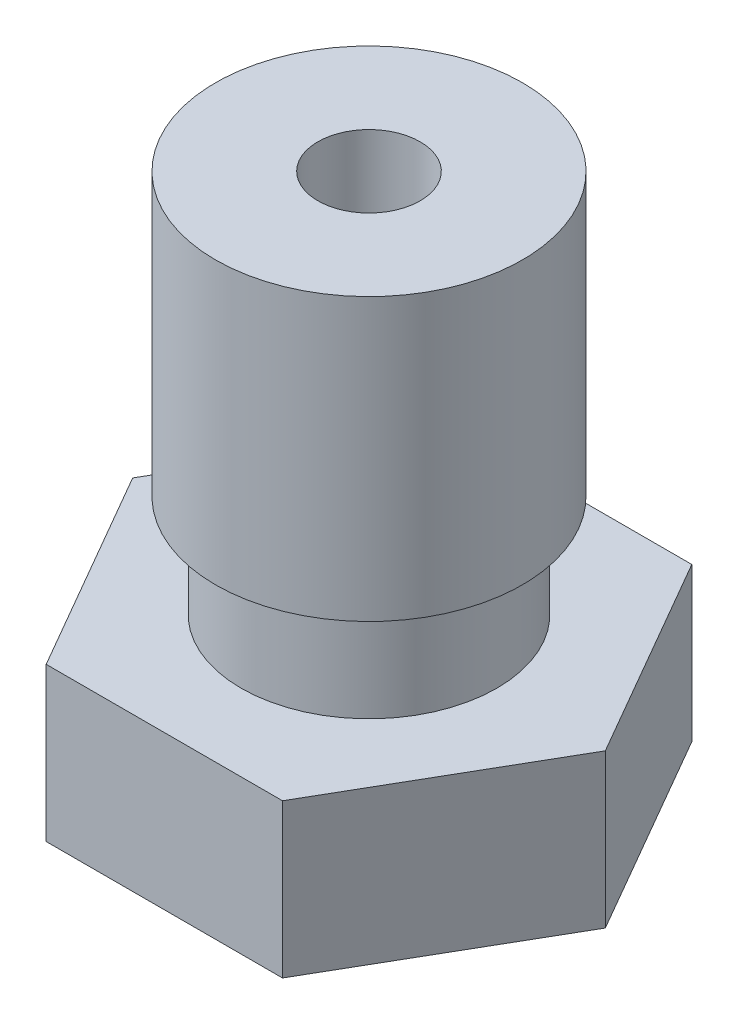
ISO-10303-21;
HEADER;
FILE_DESCRIPTION(('STEP AP214'),'2;1');
FILE_NAME('part.step','',(''),(''),'','','');
FILE_SCHEMA(('AUTOMOTIVE_DESIGN { 1 0 10303 214 1 1 1 1 }'));
ENDSEC;
DATA;
#1=APPLICATION_CONTEXT('core data for automotive mechanical design processes');
#2=APPLICATION_PROTOCOL_DEFINITION('international standard','automotive_design',2000,#1);
#3=PRODUCT_CONTEXT('',#1,'mechanical');
#4=PRODUCT('Part','Part','',(#3));
#5=PRODUCT_RELATED_PRODUCT_CATEGORY('part','',(#4));
#6=PRODUCT_DEFINITION_FORMATION('','',#4);
#7=PRODUCT_DEFINITION_CONTEXT('part definition',#1,'design');
#8=PRODUCT_DEFINITION('design','',#6,#7);
#9=PRODUCT_DEFINITION_SHAPE('','',#8);
#10=(LENGTH_UNIT() NAMED_UNIT(*) SI_UNIT(.MILLI.,.METRE.));
#11=(NAMED_UNIT(*) PLANE_ANGLE_UNIT() SI_UNIT($,.RADIAN.));
#12=(NAMED_UNIT(*) SI_UNIT($,.STERADIAN.) SOLID_ANGLE_UNIT());
#13=UNCERTAINTY_MEASURE_WITH_UNIT(LENGTH_MEASURE(1.E-05),#10,'distance_accuracy_value','');
#14=(GEOMETRIC_REPRESENTATION_CONTEXT(3) GLOBAL_UNCERTAINTY_ASSIGNED_CONTEXT((#13)) GLOBAL_UNIT_ASSIGNED_CONTEXT((#10,
#11,#12)) REPRESENTATION_CONTEXT('',''));
#15=CARTESIAN_POINT('',(0.,0.,0.));
#16=DIRECTION('',(0.,0.,1.));
#17=DIRECTION('',(1.,0.,0.));
#18=AXIS2_PLACEMENT_3D('',#15,#16,#17);
#19=CARTESIAN_POINT('',(0.,3.,0.));
#20=DIRECTION('',(0.,1.,0.));
#21=DIRECTION('',(0.,0.,1.));
#22=AXIS2_PLACEMENT_3D('',#19,#20,#21);
#23=PLANE('',#22);
#24=DIRECTION('',(-0.5,0.,-0.866025403784439));
#25=VECTOR('',#24,1.);
#26=CARTESIAN_POINT('',(4.61880215351701,3.,0.));
#27=LINE('',#26,#25);
#28=CARTESIAN_POINT('',(4.61880215351701,3.,0.));
#29=VERTEX_POINT('',#28);
#30=CARTESIAN_POINT('',(2.3094010767585,3.,-4.00000000000001));
#31=VERTEX_POINT('',#30);
#32=EDGE_CURVE('E132',#29,#31,#27,.T.);
#33=ORIENTED_EDGE('',*,*,#32,.T.);
#34=DIRECTION('',(-1.,0.,0.));
#35=VECTOR('',#34,1.);
#36=CARTESIAN_POINT('',(2.3094010767585,3.,-4.00000000000001));
#37=LINE('',#36,#35);
#38=CARTESIAN_POINT('',(-2.30940107675849,3.,-4.));
#39=VERTEX_POINT('',#38);
#40=EDGE_CURVE('E90',#31,#39,#37,.T.);
#41=ORIENTED_EDGE('',*,*,#40,.T.);
#42=DIRECTION('',(-0.5,0.,0.866025403784439));
#43=VECTOR('',#42,1.);
#44=CARTESIAN_POINT('',(-2.30940107675849,3.,-4.));
#45=LINE('',#44,#43);
#46=CARTESIAN_POINT('',(-4.618802153517,3.,0.));
#47=VERTEX_POINT('',#46);
#48=EDGE_CURVE('E103',#39,#47,#45,.T.);
#49=ORIENTED_EDGE('',*,*,#48,.T.);
#50=DIRECTION('',(0.5,0.,0.866025403784438));
#51=VECTOR('',#50,1.);
#52=CARTESIAN_POINT('',(-4.618802153517,3.,0.));
#53=LINE('',#52,#51);
#54=CARTESIAN_POINT('',(-2.3094010767585,3.,4.));
#55=VERTEX_POINT('',#54);
#56=EDGE_CURVE('E97',#47,#55,#53,.T.);
#57=ORIENTED_EDGE('',*,*,#56,.T.);
#58=DIRECTION('',(1.,0.,0.));
#59=VECTOR('',#58,1.);
#60=CARTESIAN_POINT('',(-2.3094010767585,3.,4.));
#61=LINE('',#60,#59);
#62=CARTESIAN_POINT('',(2.3094010767585,3.,4.));
#63=VERTEX_POINT('',#62);
#64=EDGE_CURVE('E101',#55,#63,#61,.T.);
#65=ORIENTED_EDGE('',*,*,#64,.T.);
#66=DIRECTION('',(0.5,0.,-0.866025403784439));
#67=VECTOR('',#66,1.);
#68=CARTESIAN_POINT('',(2.3094010767585,3.,4.));
#69=LINE('',#68,#67);
#70=EDGE_CURVE('E53',#63,#29,#69,.T.);
#71=ORIENTED_EDGE('',*,*,#70,.T.);
#72=EDGE_LOOP('',(#33,#41,#49,#57,#65,#71));
#73=FACE_BOUND('',#72,.T.);
#74=CARTESIAN_POINT('',(0.,3.,0.));
#75=DIRECTION('',(0.,-1.,0.));
#76=DIRECTION('',(0.,0.,-1.));
#77=AXIS2_PLACEMENT_3D('',#74,#75,#76);
#78=CIRCLE('',#77,2.5);
#79=CARTESIAN_POINT('',(0.,3.,-2.5));
#80=VERTEX_POINT('',#79);
#81=EDGE_CURVE('E218',#80,#80,#78,.T.);
#82=ORIENTED_EDGE('',*,*,#81,.T.);
#83=EDGE_LOOP('',(#82));
#84=FACE_BOUND('',#83,.T.);
#85=ADVANCED_FACE('F36',(#73,#84),#23,.T.);
#86=CARTESIAN_POINT('',(0.,0.,0.));
#87=DIRECTION('',(0.,1.,0.));
#88=DIRECTION('',(0.,0.,1.));
#89=AXIS2_PLACEMENT_3D('',#86,#87,#88);
#90=PLANE('',#89);
#91=CARTESIAN_POINT('',(0.,0.,0.));
#92=DIRECTION('',(0.,-1.,0.));
#93=DIRECTION('',(0.,0.,-1.));
#94=AXIS2_PLACEMENT_3D('',#91,#92,#93);
#95=CIRCLE('',#94,2.00041507641941);
#96=CARTESIAN_POINT('',(0.,0.,-2.00041507641941));
#97=VERTEX_POINT('',#96);
#98=EDGE_CURVE('E196',#97,#97,#95,.T.);
#99=ORIENTED_EDGE('',*,*,#98,.F.);
#100=EDGE_LOOP('',(#99));
#101=FACE_BOUND('',#100,.T.);
#102=DIRECTION('',(-0.5,0.,-0.866025403784439));
#103=VECTOR('',#102,1.);
#104=CARTESIAN_POINT('',(4.61880215351701,0.,0.));
#105=LINE('',#104,#103);
#106=CARTESIAN_POINT('',(4.61880215351701,0.,0.));
#107=VERTEX_POINT('',#106);
#108=CARTESIAN_POINT('',(2.3094010767585,0.,-4.00000000000001));
#109=VERTEX_POINT('',#108);
#110=EDGE_CURVE('E121',#107,#109,#105,.T.);
#111=ORIENTED_EDGE('',*,*,#110,.F.);
#112=DIRECTION('',(0.5,0.,-0.866025403784439));
#113=VECTOR('',#112,1.);
#114=CARTESIAN_POINT('',(2.3094010767585,0.,4.));
#115=LINE('',#114,#113);
#116=CARTESIAN_POINT('',(2.3094010767585,0.,4.));
#117=VERTEX_POINT('',#116);
#118=EDGE_CURVE('E82',#117,#107,#115,.T.);
#119=ORIENTED_EDGE('',*,*,#118,.F.);
#120=DIRECTION('',(1.,0.,0.));
#121=VECTOR('',#120,1.);
#122=CARTESIAN_POINT('',(-2.3094010767585,0.,4.));
#123=LINE('',#122,#121);
#124=CARTESIAN_POINT('',(-2.3094010767585,0.,4.));
#125=VERTEX_POINT('',#124);
#126=EDGE_CURVE('E76',#125,#117,#123,.T.);
#127=ORIENTED_EDGE('',*,*,#126,.F.);
#128=DIRECTION('',(0.5,0.,0.866025403784438));
#129=VECTOR('',#128,1.);
#130=CARTESIAN_POINT('',(-4.618802153517,0.,0.));
#131=LINE('',#130,#129);
#132=CARTESIAN_POINT('',(-4.618802153517,0.,0.));
#133=VERTEX_POINT('',#132);
#134=EDGE_CURVE('E111',#133,#125,#131,.T.);
#135=ORIENTED_EDGE('',*,*,#134,.F.);
#136=DIRECTION('',(-0.5,0.,0.866025403784439));
#137=VECTOR('',#136,1.);
#138=CARTESIAN_POINT('',(-2.30940107675849,0.,-4.));
#139=LINE('',#138,#137);
#140=CARTESIAN_POINT('',(-2.30940107675849,0.,-4.));
#141=VERTEX_POINT('',#140);
#142=EDGE_CURVE('E127',#141,#133,#139,.T.);
#143=ORIENTED_EDGE('',*,*,#142,.F.);
#144=DIRECTION('',(-1.,0.,0.));
#145=VECTOR('',#144,1.);
#146=CARTESIAN_POINT('',(2.3094010767585,0.,-4.00000000000001));
#147=LINE('',#146,#145);
#148=EDGE_CURVE('E124',#109,#141,#147,.T.);
#149=ORIENTED_EDGE('',*,*,#148,.F.);
#150=EDGE_LOOP('',(#111,#119,#127,#135,#143,#149));
#151=FACE_BOUND('',#150,.T.);
#152=ADVANCED_FACE('F141',(#101,#151),#90,.F.);
#153=CARTESIAN_POINT('',(4.61880215351701,3.,0.));
#154=DIRECTION('',(-0.866025403784439,0.,0.5));
#155=DIRECTION('',(0.5,0.,0.866025403784439));
#156=AXIS2_PLACEMENT_3D('',#153,#154,#155);
#157=PLANE('',#156);
#158=ORIENTED_EDGE('',*,*,#110,.T.);
#159=DIRECTION('',(0.,-1.,0.));
#160=VECTOR('',#159,1.);
#161=CARTESIAN_POINT('',(2.3094010767585,3.,-4.00000000000001));
#162=LINE('',#161,#160);
#163=EDGE_CURVE('E11',#31,#109,#162,.T.);
#164=ORIENTED_EDGE('',*,*,#163,.F.);
#165=ORIENTED_EDGE('',*,*,#32,.F.);
#166=DIRECTION('',(0.,-1.,0.));
#167=VECTOR('',#166,1.);
#168=CARTESIAN_POINT('',(4.61880215351701,3.,0.));
#169=LINE('',#168,#167);
#170=EDGE_CURVE('E117',#29,#107,#169,.T.);
#171=ORIENTED_EDGE('',*,*,#170,.T.);
#172=EDGE_LOOP('',(#158,#164,#165,#171));
#173=FACE_BOUND('',#172,.T.);
#174=ADVANCED_FACE('F38',(#173),#157,.F.);
#175=CARTESIAN_POINT('',(2.3094010767585,3.,-4.00000000000001));
#176=DIRECTION('',(0.,0.,1.));
#177=DIRECTION('',(1.,0.,0.));
#178=AXIS2_PLACEMENT_3D('',#175,#176,#177);
#179=PLANE('',#178);
#180=ORIENTED_EDGE('',*,*,#148,.T.);
#181=DIRECTION('',(0.,-1.,0.));
#182=VECTOR('',#181,1.);
#183=CARTESIAN_POINT('',(-2.30940107675849,3.,-4.));
#184=LINE('',#183,#182);
#185=EDGE_CURVE('E45',#39,#141,#184,.T.);
#186=ORIENTED_EDGE('',*,*,#185,.F.);
#187=ORIENTED_EDGE('',*,*,#40,.F.);
#188=ORIENTED_EDGE('',*,*,#163,.T.);
#189=EDGE_LOOP('',(#180,#186,#187,#188));
#190=FACE_BOUND('',#189,.T.);
#191=ADVANCED_FACE('F306',(#190),#179,.F.);
#192=CARTESIAN_POINT('',(-2.30940107675849,3.,-4.));
#193=DIRECTION('',(0.866025403784439,0.,0.5));
#194=DIRECTION('',(0.5,0.,-0.866025403784439));
#195=AXIS2_PLACEMENT_3D('',#192,#193,#194);
#196=PLANE('',#195);
#197=ORIENTED_EDGE('',*,*,#142,.T.);
#198=DIRECTION('',(0.,-1.,0.));
#199=VECTOR('',#198,1.);
#200=CARTESIAN_POINT('',(-4.618802153517,3.,0.));
#201=LINE('',#200,#199);
#202=EDGE_CURVE('E112',#47,#133,#201,.T.);
#203=ORIENTED_EDGE('',*,*,#202,.F.);
#204=ORIENTED_EDGE('',*,*,#48,.F.);
#205=ORIENTED_EDGE('',*,*,#185,.T.);
#206=EDGE_LOOP('',(#197,#203,#204,#205));
#207=FACE_BOUND('',#206,.T.);
#208=ADVANCED_FACE('F138',(#207),#196,.F.);
#209=CARTESIAN_POINT('',(-4.618802153517,3.,0.));
#210=DIRECTION('',(0.866025403784439,0.,-0.5));
#211=DIRECTION('',(-0.5,0.,-0.866025403784439));
#212=AXIS2_PLACEMENT_3D('',#209,#210,#211);
#213=PLANE('',#212);
#214=ORIENTED_EDGE('',*,*,#134,.T.);
#215=DIRECTION('',(0.,-1.,0.));
#216=VECTOR('',#215,1.);
#217=CARTESIAN_POINT('',(-2.3094010767585,3.,4.));
#218=LINE('',#217,#216);
#219=EDGE_CURVE('E108',#55,#125,#218,.T.);
#220=ORIENTED_EDGE('',*,*,#219,.F.);
#221=ORIENTED_EDGE('',*,*,#56,.F.);
#222=ORIENTED_EDGE('',*,*,#202,.T.);
#223=EDGE_LOOP('',(#214,#220,#221,#222));
#224=FACE_BOUND('',#223,.T.);
#225=ADVANCED_FACE('F109',(#224),#213,.F.);
#226=CARTESIAN_POINT('',(-2.3094010767585,3.,4.));
#227=DIRECTION('',(0.,0.,-1.));
#228=DIRECTION('',(-1.,0.,0.));
#229=AXIS2_PLACEMENT_3D('',#226,#227,#228);
#230=PLANE('',#229);
#231=ORIENTED_EDGE('',*,*,#126,.T.);
#232=DIRECTION('',(0.,-1.,0.));
#233=VECTOR('',#232,1.);
#234=CARTESIAN_POINT('',(2.3094010767585,3.,4.));
#235=LINE('',#234,#233);
#236=EDGE_CURVE('E113',#63,#117,#235,.T.);
#237=ORIENTED_EDGE('',*,*,#236,.F.);
#238=ORIENTED_EDGE('',*,*,#64,.F.);
#239=ORIENTED_EDGE('',*,*,#219,.T.);
#240=EDGE_LOOP('',(#231,#237,#238,#239));
#241=FACE_BOUND('',#240,.T.);
#242=ADVANCED_FACE('F115',(#241),#230,.F.);
#243=CARTESIAN_POINT('',(2.3094010767585,3.,4.));
#244=DIRECTION('',(-0.866025403784439,0.,-0.5));
#245=DIRECTION('',(-0.5,0.,0.866025403784439));
#246=AXIS2_PLACEMENT_3D('',#243,#244,#245);
#247=PLANE('',#246);
#248=ORIENTED_EDGE('',*,*,#118,.T.);
#249=ORIENTED_EDGE('',*,*,#170,.F.);
#250=ORIENTED_EDGE('',*,*,#70,.F.);
#251=ORIENTED_EDGE('',*,*,#236,.T.);
#252=EDGE_LOOP('',(#248,#249,#250,#251));
#253=FACE_BOUND('',#252,.T.);
#254=ADVANCED_FACE('F145',(#253),#247,.F.);
#255=CARTESIAN_POINT('',(0.,3.,0.));
#256=DIRECTION('',(0.,-1.,0.));
#257=DIRECTION('',(0.,0.,-1.));
#258=AXIS2_PLACEMENT_3D('',#255,#256,#257);
#259=CYLINDRICAL_SURFACE('',#258,1.);
#260=CARTESIAN_POINT('',(0.,0.,0.));
#261=DIRECTION('',(0.,1.,0.));
#262=DIRECTION('',(0.,0.,1.));
#263=AXIS2_PLACEMENT_3D('',#260,#261,#262);
#264=CIRCLE('',#263,1.);
#265=CARTESIAN_POINT('',(0.,0.,1.));
#266=VERTEX_POINT('',#265);
#267=EDGE_CURVE('E125',#266,#266,#264,.T.);
#268=ORIENTED_EDGE('',*,*,#267,.F.);
#269=EDGE_LOOP('',(#268));
#270=FACE_BOUND('',#269,.T.);
#271=CARTESIAN_POINT('',(0.,10.5,0.));
#272=DIRECTION('',(0.,-1.,0.));
#273=DIRECTION('',(0.,0.,-1.));
#274=AXIS2_PLACEMENT_3D('',#271,#272,#273);
#275=CIRCLE('',#274,1.);
#276=CARTESIAN_POINT('',(0.,10.5,-1.));
#277=VERTEX_POINT('',#276);
#278=EDGE_CURVE('E203',#277,#277,#275,.T.);
#279=ORIENTED_EDGE('',*,*,#278,.F.);
#280=EDGE_LOOP('',(#279));
#281=FACE_BOUND('',#280,.T.);
#282=ADVANCED_FACE('F147',(#270,#281),#259,.F.);
#283=CARTESIAN_POINT('',(0.,-2.,0.));
#284=DIRECTION('',(0.,-1.,0.));
#285=DIRECTION('',(0.,0.,-1.));
#286=AXIS2_PLACEMENT_3D('',#283,#284,#285);
#287=CYLINDRICAL_SURFACE('',#286,2.5);
#288=ORIENTED_EDGE('',*,*,#81,.F.);
#289=EDGE_LOOP('',(#288));
#290=FACE_BOUND('',#289,.T.);
#291=CARTESIAN_POINT('',(0.,5.,0.));
#292=DIRECTION('',(0.,-1.,0.));
#293=DIRECTION('',(0.,0.,-1.));
#294=AXIS2_PLACEMENT_3D('',#291,#292,#293);
#295=CIRCLE('',#294,2.5);
#296=CARTESIAN_POINT('',(0.,5.,-2.5));
#297=VERTEX_POINT('',#296);
#298=EDGE_CURVE('E215',#297,#297,#295,.T.);
#299=ORIENTED_EDGE('',*,*,#298,.T.);
#300=EDGE_LOOP('',(#299));
#301=FACE_BOUND('',#300,.T.);
#302=ADVANCED_FACE('F153',(#290,#301),#287,.T.);
#303=CARTESIAN_POINT('',(0.,5.,0.));
#304=DIRECTION('',(0.,1.,0.));
#305=DIRECTION('',(0.,0.,1.));
#306=AXIS2_PLACEMENT_3D('',#303,#304,#305);
#307=PLANE('',#306);
#308=ORIENTED_EDGE('',*,*,#298,.F.);
#309=EDGE_LOOP('',(#308));
#310=FACE_BOUND('',#309,.T.);
#311=CARTESIAN_POINT('',(0.,5.,0.));
#312=DIRECTION('',(0.,-1.,0.));
#313=DIRECTION('',(0.,0.,-1.));
#314=AXIS2_PLACEMENT_3D('',#311,#312,#313);
#315=CIRCLE('',#314,3.);
#316=CARTESIAN_POINT('',(0.,5.,-3.));
#317=VERTEX_POINT('',#316);
#318=EDGE_CURVE('E212',#317,#317,#315,.T.);
#319=ORIENTED_EDGE('',*,*,#318,.T.);
#320=EDGE_LOOP('',(#319));
#321=FACE_BOUND('',#320,.T.);
#322=ADVANCED_FACE('F167',(#310,#321),#307,.F.);
#323=CARTESIAN_POINT('',(0.,-2.,0.));
#324=DIRECTION('',(0.,-1.,0.));
#325=DIRECTION('',(0.,0.,-1.));
#326=AXIS2_PLACEMENT_3D('',#323,#324,#325);
#327=CYLINDRICAL_SURFACE('',#326,3.);
#328=ORIENTED_EDGE('',*,*,#318,.F.);
#329=EDGE_LOOP('',(#328));
#330=FACE_BOUND('',#329,.T.);
#331=CARTESIAN_POINT('',(0.,10.5,0.));
#332=DIRECTION('',(0.,-1.,0.));
#333=DIRECTION('',(0.,0.,-1.));
#334=AXIS2_PLACEMENT_3D('',#331,#332,#333);
#335=CIRCLE('',#334,3.);
#336=CARTESIAN_POINT('',(0.,10.5,-3.));
#337=VERTEX_POINT('',#336);
#338=EDGE_CURVE('E209',#337,#337,#335,.T.);
#339=ORIENTED_EDGE('',*,*,#338,.T.);
#340=EDGE_LOOP('',(#339));
#341=FACE_BOUND('',#340,.T.);
#342=ADVANCED_FACE('F171',(#330,#341),#327,.T.);
#343=CARTESIAN_POINT('',(0.,10.5,0.));
#344=DIRECTION('',(0.,-1.,0.));
#345=DIRECTION('',(0.,0.,-1.));
#346=AXIS2_PLACEMENT_3D('',#343,#344,#345);
#347=PLANE('',#346);
#348=ORIENTED_EDGE('',*,*,#338,.F.);
#349=EDGE_LOOP('',(#348));
#350=FACE_BOUND('',#349,.T.);
#351=ORIENTED_EDGE('',*,*,#278,.T.);
#352=EDGE_LOOP('',(#351));
#353=FACE_BOUND('',#352,.T.);
#354=ADVANCED_FACE('F175',(#350,#353),#347,.F.);
#355=CARTESIAN_POINT('',(0.,0.,0.));
#356=DIRECTION('',(0.,1.,0.));
#357=DIRECTION('',(0.,0.,1.));
#358=AXIS2_PLACEMENT_3D('',#355,#356,#357);
#359=CONICAL_SURFACE('',#358,1.,0.369684288795301);
#360=CARTESIAN_POINT('',(0.,-2.,0.));
#361=DIRECTION('',(0.,-1.,0.));
#362=DIRECTION('',(0.,0.,-1.));
#363=AXIS2_PLACEMENT_3D('',#360,#361,#362);
#364=CIRCLE('',#363,0.225);
#365=CARTESIAN_POINT('',(0.,-2.,-0.225));
#366=VERTEX_POINT('',#365);
#367=EDGE_CURVE('E200',#366,#366,#364,.T.);
#368=ORIENTED_EDGE('',*,*,#367,.T.);
#369=EDGE_LOOP('',(#368));
#370=FACE_BOUND('',#369,.T.);
#371=ORIENTED_EDGE('',*,*,#267,.T.);
#372=EDGE_LOOP('',(#371));
#373=FACE_BOUND('',#372,.T.);
#374=ADVANCED_FACE('F179',(#370,#373),#359,.F.);
#375=CARTESIAN_POINT('',(0.,-2.,0.));
#376=DIRECTION('',(0.,-1.,0.));
#377=DIRECTION('',(0.,0.,-1.));
#378=AXIS2_PLACEMENT_3D('',#375,#376,#377);
#379=PLANE('',#378);
#380=CARTESIAN_POINT('',(0.,-2.,0.));
#381=DIRECTION('',(0.,-1.,0.));
#382=DIRECTION('',(0.,0.,-1.));
#383=AXIS2_PLACEMENT_3D('',#380,#381,#382);
#384=CIRCLE('',#383,0.6);
#385=CARTESIAN_POINT('',(0.,-2.,-0.6));
#386=VERTEX_POINT('',#385);
#387=EDGE_CURVE('E199',#386,#386,#384,.T.);
#388=ORIENTED_EDGE('',*,*,#387,.T.);
#389=EDGE_LOOP('',(#388));
#390=FACE_BOUND('',#389,.T.);
#391=ORIENTED_EDGE('',*,*,#367,.F.);
#392=EDGE_LOOP('',(#391));
#393=FACE_BOUND('',#392,.T.);
#394=ADVANCED_FACE('F183',(#390,#393),#379,.T.);
#395=CARTESIAN_POINT('',(0.,-2.,0.));
#396=DIRECTION('',(0.,1.,0.));
#397=DIRECTION('',(0.,0.,1.));
#398=AXIS2_PLACEMENT_3D('',#395,#396,#397);
#399=CONICAL_SURFACE('',#398,0.6,0.610865238198013);
#400=ORIENTED_EDGE('',*,*,#98,.T.);
#401=EDGE_LOOP('',(#400));
#402=FACE_BOUND('',#401,.T.);
#403=ORIENTED_EDGE('',*,*,#387,.F.);
#404=EDGE_LOOP('',(#403));
#405=FACE_BOUND('',#404,.T.);
#406=ADVANCED_FACE('F187',(#402,#405),#399,.T.);
#407=CLOSED_SHELL('',(#85,#152,#174,#191,#208,#225,#242,#254,#282,#302,#322,#342,#354,#374,#394,#406));
#408=MANIFOLD_SOLID_BREP('B2',#407);
#409=ADVANCED_BREP_SHAPE_REPRESENTATION('',(#18,#408),#14);
#410=SHAPE_DEFINITION_REPRESENTATION(#9,#409);
ENDSEC;
END-ISO-10303-21;
